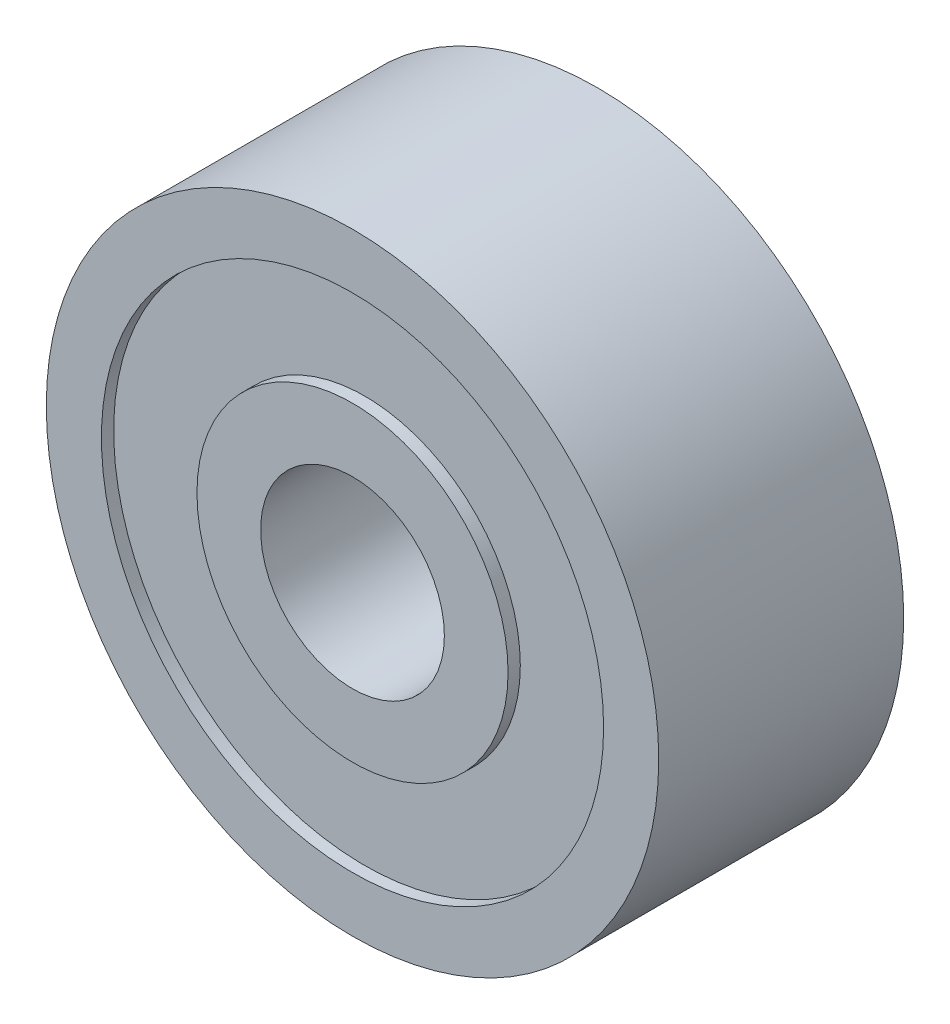
ISO-10303-21;
HEADER;
FILE_DESCRIPTION(('STEP AP214'),'2;1');
FILE_NAME('part.step','',(''),(''),'','','');
FILE_SCHEMA(('AUTOMOTIVE_DESIGN { 1 0 10303 214 1 1 1 1 }'));
ENDSEC;
DATA;
#1=APPLICATION_CONTEXT('core data for automotive mechanical design processes');
#2=APPLICATION_PROTOCOL_DEFINITION('international standard','automotive_design',2000,#1);
#3=PRODUCT_CONTEXT('',#1,'mechanical');
#4=PRODUCT('Part','Part','',(#3));
#5=PRODUCT_RELATED_PRODUCT_CATEGORY('part','',(#4));
#6=PRODUCT_DEFINITION_FORMATION('','',#4);
#7=PRODUCT_DEFINITION_CONTEXT('part definition',#1,'design');
#8=PRODUCT_DEFINITION('design','',#6,#7);
#9=PRODUCT_DEFINITION_SHAPE('','',#8);
#10=(LENGTH_UNIT() NAMED_UNIT(*) SI_UNIT(.MILLI.,.METRE.));
#11=(NAMED_UNIT(*) PLANE_ANGLE_UNIT() SI_UNIT($,.RADIAN.));
#12=(NAMED_UNIT(*) SI_UNIT($,.STERADIAN.) SOLID_ANGLE_UNIT());
#13=UNCERTAINTY_MEASURE_WITH_UNIT(LENGTH_MEASURE(1.E-05),#10,'distance_accuracy_value','');
#14=(GEOMETRIC_REPRESENTATION_CONTEXT(3) GLOBAL_UNCERTAINTY_ASSIGNED_CONTEXT((#13)) GLOBAL_UNIT_ASSIGNED_CONTEXT((#10,
#11,#12)) REPRESENTATION_CONTEXT('',''));
#15=CARTESIAN_POINT('',(0.,0.,0.));
#16=DIRECTION('',(0.,0.,1.));
#17=DIRECTION('',(1.,0.,0.));
#18=AXIS2_PLACEMENT_3D('',#15,#16,#17);
#19=CARTESIAN_POINT('',(0.,0.,-2.));
#20=DIRECTION('',(0.,0.,1.));
#21=DIRECTION('',(1.,0.,0.));
#22=AXIS2_PLACEMENT_3D('',#19,#20,#21);
#23=PLANE('',#22);
#24=CARTESIAN_POINT('',(0.,0.,-2.));
#25=DIRECTION('',(0.,0.,1.));
#26=DIRECTION('',(1.,0.,0.));
#27=AXIS2_PLACEMENT_3D('',#24,#25,#26);
#28=CIRCLE('',#27,1.5);
#29=CARTESIAN_POINT('',(1.5,0.,-2.));
#30=VERTEX_POINT('',#29);
#31=EDGE_CURVE('E41',#30,#30,#28,.T.);
#32=ORIENTED_EDGE('',*,*,#31,.T.);
#33=EDGE_LOOP('',(#32));
#34=FACE_BOUND('',#33,.T.);
#35=CARTESIAN_POINT('',(0.,0.,-2.));
#36=DIRECTION('',(0.,0.,1.));
#37=DIRECTION('',(1.,0.,0.));
#38=AXIS2_PLACEMENT_3D('',#35,#36,#37);
#39=CIRCLE('',#38,2.54);
#40=CARTESIAN_POINT('',(2.54,0.,-2.));
#41=VERTEX_POINT('',#40);
#42=EDGE_CURVE('E67',#41,#41,#39,.T.);
#43=ORIENTED_EDGE('',*,*,#42,.F.);
#44=EDGE_LOOP('',(#43));
#45=FACE_BOUND('',#44,.T.);
#46=ADVANCED_FACE('F30',(#34,#45),#23,.F.);
#47=CARTESIAN_POINT('',(0.,0.,2.));
#48=DIRECTION('',(0.,0.,1.));
#49=DIRECTION('',(1.,0.,0.));
#50=AXIS2_PLACEMENT_3D('',#47,#48,#49);
#51=PLANE('',#50);
#52=CARTESIAN_POINT('',(0.,0.,2.));
#53=DIRECTION('',(0.,0.,1.));
#54=DIRECTION('',(1.,0.,0.));
#55=AXIS2_PLACEMENT_3D('',#52,#53,#54);
#56=CIRCLE('',#55,1.5);
#57=CARTESIAN_POINT('',(1.5,0.,2.));
#58=VERTEX_POINT('',#57);
#59=EDGE_CURVE('E43',#58,#58,#56,.T.);
#60=ORIENTED_EDGE('',*,*,#59,.F.);
#61=EDGE_LOOP('',(#60));
#62=FACE_BOUND('',#61,.T.);
#63=CARTESIAN_POINT('',(0.,0.,2.));
#64=DIRECTION('',(0.,0.,1.));
#65=DIRECTION('',(1.,0.,0.));
#66=AXIS2_PLACEMENT_3D('',#63,#64,#65);
#67=CIRCLE('',#66,2.54);
#68=CARTESIAN_POINT('',(2.54,0.,2.));
#69=VERTEX_POINT('',#68);
#70=EDGE_CURVE('E55',#69,#69,#67,.T.);
#71=ORIENTED_EDGE('',*,*,#70,.T.);
#72=EDGE_LOOP('',(#71));
#73=FACE_BOUND('',#72,.T.);
#74=ADVANCED_FACE('F83',(#62,#73),#51,.T.);
#75=CARTESIAN_POINT('',(0.,0.,2.));
#76=DIRECTION('',(0.,0.,-1.));
#77=DIRECTION('',(-1.,0.,0.));
#78=AXIS2_PLACEMENT_3D('',#75,#76,#77);
#79=CYLINDRICAL_SURFACE('',#78,5.);
#80=CARTESIAN_POINT('',(0.,0.,2.));
#81=DIRECTION('',(0.,0.,1.));
#82=DIRECTION('',(1.,0.,0.));
#83=AXIS2_PLACEMENT_3D('',#80,#81,#82);
#84=CIRCLE('',#83,5.);
#85=CARTESIAN_POINT('',(5.,0.,2.));
#86=VERTEX_POINT('',#85);
#87=EDGE_CURVE('E10',#86,#86,#84,.T.);
#88=ORIENTED_EDGE('',*,*,#87,.F.);
#89=EDGE_LOOP('',(#88));
#90=FACE_BOUND('',#89,.T.);
#91=CARTESIAN_POINT('',(0.,0.,-2.));
#92=DIRECTION('',(0.,0.,1.));
#93=DIRECTION('',(1.,0.,0.));
#94=AXIS2_PLACEMENT_3D('',#91,#92,#93);
#95=CIRCLE('',#94,5.);
#96=CARTESIAN_POINT('',(5.,0.,-2.));
#97=VERTEX_POINT('',#96);
#98=EDGE_CURVE('E34',#97,#97,#95,.T.);
#99=ORIENTED_EDGE('',*,*,#98,.T.);
#100=EDGE_LOOP('',(#99));
#101=FACE_BOUND('',#100,.T.);
#102=ADVANCED_FACE('F32',(#90,#101),#79,.T.);
#103=CARTESIAN_POINT('',(0.,0.,2.));
#104=DIRECTION('',(0.,0.,1.));
#105=DIRECTION('',(1.,0.,0.));
#106=AXIS2_PLACEMENT_3D('',#103,#104,#105);
#107=CIRCLE('',#106,4.1);
#108=CARTESIAN_POINT('',(4.1,0.,2.));
#109=VERTEX_POINT('',#108);
#110=EDGE_CURVE('E49',#109,#109,#107,.T.);
#111=ORIENTED_EDGE('',*,*,#110,.F.);
#112=EDGE_LOOP('',(#111));
#113=FACE_BOUND('',#112,.T.);
#114=ORIENTED_EDGE('',*,*,#87,.T.);
#115=EDGE_LOOP('',(#114));
#116=FACE_BOUND('',#115,.T.);
#117=ADVANCED_FACE('F91',(#113,#116),#51,.T.);
#118=CARTESIAN_POINT('',(0.,0.,-2.));
#119=DIRECTION('',(0.,0.,1.));
#120=DIRECTION('',(1.,0.,0.));
#121=AXIS2_PLACEMENT_3D('',#118,#119,#120);
#122=CIRCLE('',#121,4.1);
#123=CARTESIAN_POINT('',(4.1,0.,-2.));
#124=VERTEX_POINT('',#123);
#125=EDGE_CURVE('E61',#124,#124,#122,.T.);
#126=ORIENTED_EDGE('',*,*,#125,.T.);
#127=EDGE_LOOP('',(#126));
#128=FACE_BOUND('',#127,.T.);
#129=ORIENTED_EDGE('',*,*,#98,.F.);
#130=EDGE_LOOP('',(#129));
#131=FACE_BOUND('',#130,.T.);
#132=ADVANCED_FACE('F85',(#128,#131),#23,.F.);
#133=CARTESIAN_POINT('',(0.,0.,-2.));
#134=DIRECTION('',(0.,0.,1.));
#135=DIRECTION('',(1.,0.,0.));
#136=AXIS2_PLACEMENT_3D('',#133,#134,#135);
#137=CYLINDRICAL_SURFACE('',#136,1.5);
#138=ORIENTED_EDGE('',*,*,#31,.F.);
#139=EDGE_LOOP('',(#138));
#140=FACE_BOUND('',#139,.T.);
#141=ORIENTED_EDGE('',*,*,#59,.T.);
#142=EDGE_LOOP('',(#141));
#143=FACE_BOUND('',#142,.T.);
#144=ADVANCED_FACE('F93',(#140,#143),#137,.F.);
#145=CARTESIAN_POINT('',(0.,0.,1.8));
#146=DIRECTION('',(0.,0.,1.));
#147=DIRECTION('',(1.,0.,0.));
#148=AXIS2_PLACEMENT_3D('',#145,#146,#147);
#149=CYLINDRICAL_SURFACE('',#148,4.1);
#150=CARTESIAN_POINT('',(0.,0.,1.8));
#151=DIRECTION('',(0.,0.,1.));
#152=DIRECTION('',(1.,0.,0.));
#153=AXIS2_PLACEMENT_3D('',#150,#151,#152);
#154=CIRCLE('',#153,4.1);
#155=CARTESIAN_POINT('',(4.1,0.,1.8));
#156=VERTEX_POINT('',#155);
#157=EDGE_CURVE('E46',#156,#156,#154,.T.);
#158=ORIENTED_EDGE('',*,*,#157,.F.);
#159=EDGE_LOOP('',(#158));
#160=FACE_BOUND('',#159,.T.);
#161=ORIENTED_EDGE('',*,*,#110,.T.);
#162=EDGE_LOOP('',(#161));
#163=FACE_BOUND('',#162,.T.);
#164=ADVANCED_FACE('F99',(#160,#163),#149,.F.);
#165=CARTESIAN_POINT('',(0.,0.,1.8));
#166=DIRECTION('',(0.,0.,1.));
#167=DIRECTION('',(1.,0.,0.));
#168=AXIS2_PLACEMENT_3D('',#165,#166,#167);
#169=PLANE('',#168);
#170=CARTESIAN_POINT('',(0.,0.,1.8));
#171=DIRECTION('',(0.,0.,1.));
#172=DIRECTION('',(1.,0.,0.));
#173=AXIS2_PLACEMENT_3D('',#170,#171,#172);
#174=CIRCLE('',#173,2.54);
#175=CARTESIAN_POINT('',(2.54,0.,1.8));
#176=VERTEX_POINT('',#175);
#177=EDGE_CURVE('E52',#176,#176,#174,.T.);
#178=ORIENTED_EDGE('',*,*,#177,.F.);
#179=EDGE_LOOP('',(#178));
#180=FACE_BOUND('',#179,.T.);
#181=ORIENTED_EDGE('',*,*,#157,.T.);
#182=EDGE_LOOP('',(#181));
#183=FACE_BOUND('',#182,.T.);
#184=ADVANCED_FACE('F130',(#180,#183),#169,.T.);
#185=CARTESIAN_POINT('',(0.,0.,1.8));
#186=DIRECTION('',(0.,0.,1.));
#187=DIRECTION('',(1.,0.,0.));
#188=AXIS2_PLACEMENT_3D('',#185,#186,#187);
#189=CYLINDRICAL_SURFACE('',#188,2.54);
#190=ORIENTED_EDGE('',*,*,#177,.T.);
#191=EDGE_LOOP('',(#190));
#192=FACE_BOUND('',#191,.T.);
#193=ORIENTED_EDGE('',*,*,#70,.F.);
#194=EDGE_LOOP('',(#193));
#195=FACE_BOUND('',#194,.T.);
#196=ADVANCED_FACE('F140',(#192,#195),#189,.T.);
#197=CARTESIAN_POINT('',(0.,0.,-1.8));
#198=DIRECTION('',(0.,0.,-1.));
#199=DIRECTION('',(1.,0.,0.));
#200=AXIS2_PLACEMENT_3D('',#197,#198,#199);
#201=PLANE('',#200);
#202=CARTESIAN_POINT('',(0.,0.,-1.8));
#203=DIRECTION('',(0.,0.,1.));
#204=DIRECTION('',(1.,0.,0.));
#205=AXIS2_PLACEMENT_3D('',#202,#203,#204);
#206=CIRCLE('',#205,4.1);
#207=CARTESIAN_POINT('',(4.1,0.,-1.8));
#208=VERTEX_POINT('',#207);
#209=EDGE_CURVE('E58',#208,#208,#206,.T.);
#210=ORIENTED_EDGE('',*,*,#209,.F.);
#211=EDGE_LOOP('',(#210));
#212=FACE_BOUND('',#211,.T.);
#213=CARTESIAN_POINT('',(0.,0.,-1.8));
#214=DIRECTION('',(0.,0.,1.));
#215=DIRECTION('',(1.,0.,0.));
#216=AXIS2_PLACEMENT_3D('',#213,#214,#215);
#217=CIRCLE('',#216,2.54);
#218=CARTESIAN_POINT('',(2.54,0.,-1.8));
#219=VERTEX_POINT('',#218);
#220=EDGE_CURVE('E64',#219,#219,#217,.T.);
#221=ORIENTED_EDGE('',*,*,#220,.T.);
#222=EDGE_LOOP('',(#221));
#223=FACE_BOUND('',#222,.T.);
#224=ADVANCED_FACE('F73',(#212,#223),#201,.T.);
#225=CARTESIAN_POINT('',(0.,0.,-1.8));
#226=DIRECTION('',(0.,0.,-1.));
#227=DIRECTION('',(-1.,0.,0.));
#228=AXIS2_PLACEMENT_3D('',#225,#226,#227);
#229=CYLINDRICAL_SURFACE('',#228,4.1);
#230=ORIENTED_EDGE('',*,*,#209,.T.);
#231=EDGE_LOOP('',(#230));
#232=FACE_BOUND('',#231,.T.);
#233=ORIENTED_EDGE('',*,*,#125,.F.);
#234=EDGE_LOOP('',(#233));
#235=FACE_BOUND('',#234,.T.);
#236=ADVANCED_FACE('F78',(#232,#235),#229,.F.);
#237=CARTESIAN_POINT('',(0.,0.,-1.8));
#238=DIRECTION('',(0.,0.,-1.));
#239=DIRECTION('',(-1.,0.,0.));
#240=AXIS2_PLACEMENT_3D('',#237,#238,#239);
#241=CYLINDRICAL_SURFACE('',#240,2.54);
#242=ORIENTED_EDGE('',*,*,#220,.F.);
#243=EDGE_LOOP('',(#242));
#244=FACE_BOUND('',#243,.T.);
#245=ORIENTED_EDGE('',*,*,#42,.T.);
#246=EDGE_LOOP('',(#245));
#247=FACE_BOUND('',#246,.T.);
#248=ADVANCED_FACE('F75',(#244,#247),#241,.T.);
#249=CLOSED_SHELL('',(#46,#74,#102,#117,#132,#144,#164,#184,#196,#224,#236,#248));
#250=MANIFOLD_SOLID_BREP('B2',#249);
#251=ADVANCED_BREP_SHAPE_REPRESENTATION('',(#18,#250),#14);
#252=SHAPE_DEFINITION_REPRESENTATION(#9,#251);
ENDSEC;
END-ISO-10303-21;
